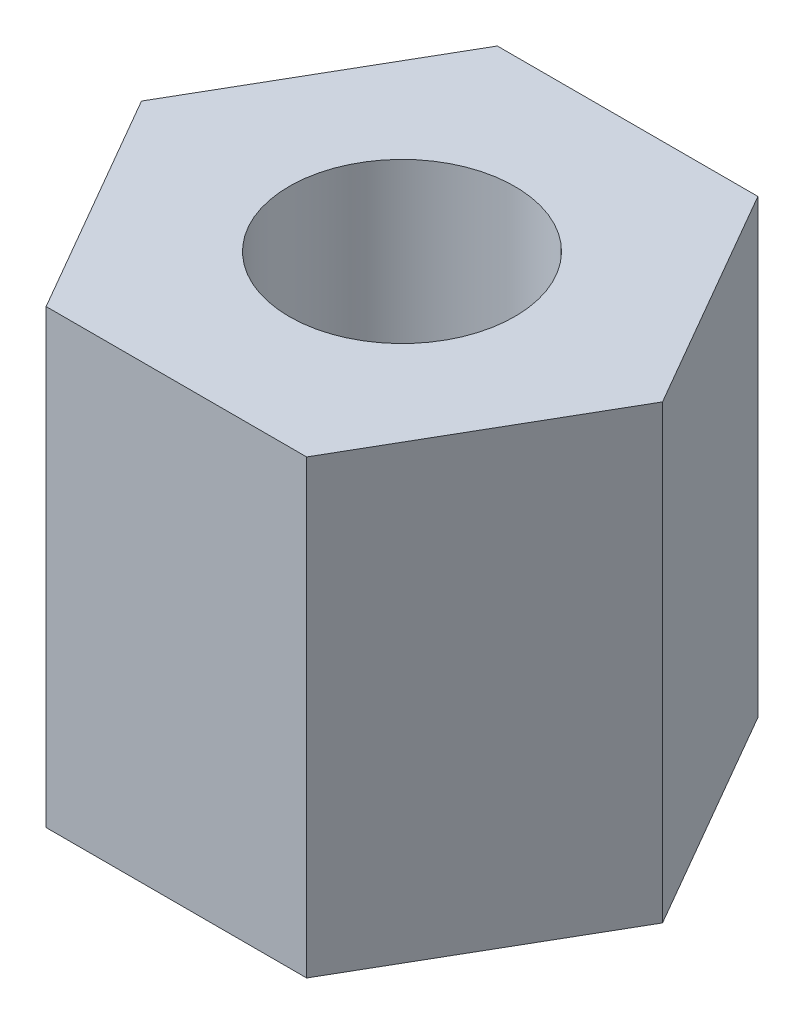
ISO-10303-21;
HEADER;
FILE_DESCRIPTION(('STEP AP214'),'2;1');
FILE_NAME('part.step','',(''),(''),'','','');
FILE_SCHEMA(('AUTOMOTIVE_DESIGN { 1 0 10303 214 1 1 1 1 }'));
ENDSEC;
DATA;
#1=APPLICATION_CONTEXT('core data for automotive mechanical design processes');
#2=APPLICATION_PROTOCOL_DEFINITION('international standard','automotive_design',2000,#1);
#3=PRODUCT_CONTEXT('',#1,'mechanical');
#4=PRODUCT('Part','Part','',(#3));
#5=PRODUCT_RELATED_PRODUCT_CATEGORY('part','',(#4));
#6=PRODUCT_DEFINITION_FORMATION('','',#4);
#7=PRODUCT_DEFINITION_CONTEXT('part definition',#1,'design');
#8=PRODUCT_DEFINITION('design','',#6,#7);
#9=PRODUCT_DEFINITION_SHAPE('','',#8);
#10=(LENGTH_UNIT() NAMED_UNIT(*) SI_UNIT(.MILLI.,.METRE.));
#11=(NAMED_UNIT(*) PLANE_ANGLE_UNIT() SI_UNIT($,.RADIAN.));
#12=(NAMED_UNIT(*) SI_UNIT($,.STERADIAN.) SOLID_ANGLE_UNIT());
#13=UNCERTAINTY_MEASURE_WITH_UNIT(LENGTH_MEASURE(1.E-05),#10,'distance_accuracy_value','');
#14=(GEOMETRIC_REPRESENTATION_CONTEXT(3) GLOBAL_UNCERTAINTY_ASSIGNED_CONTEXT((#13)) GLOBAL_UNIT_ASSIGNED_CONTEXT((#10,
#11,#12)) REPRESENTATION_CONTEXT('',''));
#15=CARTESIAN_POINT('',(0.,0.,0.));
#16=DIRECTION('',(0.,0.,1.));
#17=DIRECTION('',(1.,0.,0.));
#18=AXIS2_PLACEMENT_3D('',#15,#16,#17);
#19=CARTESIAN_POINT('',(0.,4.,0.));
#20=DIRECTION('',(0.,1.,0.));
#21=DIRECTION('',(0.,0.,1.));
#22=AXIS2_PLACEMENT_3D('',#19,#20,#21);
#23=PLANE('',#22);
#24=DIRECTION('',(0.499999999999995,0.,-0.866025403784442));
#25=VECTOR('',#24,1.);
#26=CARTESIAN_POINT('',(1.15470053837928,4.,1.99999999999999));
#27=LINE('',#26,#25);
#28=CARTESIAN_POINT('',(1.15470053837928,4.,1.99999999999999));
#29=VERTEX_POINT('',#28);
#30=CARTESIAN_POINT('',(2.3094010767585,4.,0.));
#31=VERTEX_POINT('',#30);
#32=EDGE_CURVE('E146',#29,#31,#27,.T.);
#33=ORIENTED_EDGE('',*,*,#32,.T.);
#34=DIRECTION('',(-0.500000000000001,0.,-0.866025403784438));
#35=VECTOR('',#34,1.);
#36=CARTESIAN_POINT('',(2.3094010767585,4.,0.));
#37=LINE('',#36,#35);
#38=CARTESIAN_POINT('',(1.15470053837925,4.,-2.));
#39=VERTEX_POINT('',#38);
#40=EDGE_CURVE('E94',#31,#39,#37,.T.);
#41=ORIENTED_EDGE('',*,*,#40,.T.);
#42=DIRECTION('',(-1.,0.,0.));
#43=VECTOR('',#42,1.);
#44=CARTESIAN_POINT('',(1.15470053837925,4.,-2.));
#45=LINE('',#44,#43);
#46=CARTESIAN_POINT('',(-1.15470053837926,4.,-2.));
#47=VERTEX_POINT('',#46);
#48=EDGE_CURVE('E107',#39,#47,#45,.T.);
#49=ORIENTED_EDGE('',*,*,#48,.T.);
#50=DIRECTION('',(-0.499999999999995,0.,0.866025403784442));
#51=VECTOR('',#50,1.);
#52=CARTESIAN_POINT('',(-1.15470053837926,4.,-2.));
#53=LINE('',#52,#51);
#54=CARTESIAN_POINT('',(-2.3094010767585,4.,0.));
#55=VERTEX_POINT('',#54);
#56=EDGE_CURVE('E101',#47,#55,#53,.T.);
#57=ORIENTED_EDGE('',*,*,#56,.T.);
#58=DIRECTION('',(0.500000000000007,0.,0.866025403784435));
#59=VECTOR('',#58,1.);
#60=CARTESIAN_POINT('',(-2.3094010767585,4.,0.));
#61=LINE('',#60,#59);
#62=CARTESIAN_POINT('',(-1.15470053837923,4.,2.00000000000001));
#63=VERTEX_POINT('',#62);
#64=EDGE_CURVE('E105',#55,#63,#61,.T.);
#65=ORIENTED_EDGE('',*,*,#64,.T.);
#66=DIRECTION('',(1.,0.,0.));
#67=VECTOR('',#66,1.);
#68=CARTESIAN_POINT('',(-1.15470053837923,4.,2.00000000000001));
#69=LINE('',#68,#67);
#70=EDGE_CURVE('E57',#63,#29,#69,.T.);
#71=ORIENTED_EDGE('',*,*,#70,.T.);
#72=EDGE_LOOP('',(#33,#41,#49,#57,#65,#71));
#73=FACE_BOUND('',#72,.T.);
#74=CARTESIAN_POINT('',(0.,4.,0.));
#75=DIRECTION('',(0.,1.,0.));
#76=DIRECTION('',(0.,0.,1.));
#77=AXIS2_PLACEMENT_3D('',#74,#75,#76);
#78=CIRCLE('',#77,1.);
#79=CARTESIAN_POINT('',(0.,4.,1.));
#80=VERTEX_POINT('',#79);
#81=EDGE_CURVE('E134',#80,#80,#78,.T.);
#82=ORIENTED_EDGE('',*,*,#81,.F.);
#83=EDGE_LOOP('',(#82));
#84=FACE_BOUND('',#83,.T.);
#85=ADVANCED_FACE('F39',(#73,#84),#23,.T.);
#86=CARTESIAN_POINT('',(0.,0.,0.));
#87=DIRECTION('',(0.,1.,0.));
#88=DIRECTION('',(0.,0.,1.));
#89=AXIS2_PLACEMENT_3D('',#86,#87,#88);
#90=PLANE('',#89);
#91=DIRECTION('',(0.499999999999995,0.,-0.866025403784442));
#92=VECTOR('',#91,1.);
#93=CARTESIAN_POINT('',(1.15470053837928,0.,1.99999999999999));
#94=LINE('',#93,#92);
#95=CARTESIAN_POINT('',(1.15470053837928,0.,1.99999999999999));
#96=VERTEX_POINT('',#95);
#97=CARTESIAN_POINT('',(2.3094010767585,0.,0.));
#98=VERTEX_POINT('',#97);
#99=EDGE_CURVE('E129',#96,#98,#94,.T.);
#100=ORIENTED_EDGE('',*,*,#99,.F.);
#101=DIRECTION('',(1.,0.,0.));
#102=VECTOR('',#101,1.);
#103=CARTESIAN_POINT('',(-1.15470053837923,0.,2.00000000000001));
#104=LINE('',#103,#102);
#105=CARTESIAN_POINT('',(-1.15470053837923,0.,2.00000000000001));
#106=VERTEX_POINT('',#105);
#107=EDGE_CURVE('E86',#106,#96,#104,.T.);
#108=ORIENTED_EDGE('',*,*,#107,.F.);
#109=DIRECTION('',(0.500000000000007,0.,0.866025403784435));
#110=VECTOR('',#109,1.);
#111=CARTESIAN_POINT('',(-2.3094010767585,0.,0.));
#112=LINE('',#111,#110);
#113=CARTESIAN_POINT('',(-2.3094010767585,0.,0.));
#114=VERTEX_POINT('',#113);
#115=EDGE_CURVE('E80',#114,#106,#112,.T.);
#116=ORIENTED_EDGE('',*,*,#115,.F.);
#117=DIRECTION('',(-0.499999999999995,0.,0.866025403784442));
#118=VECTOR('',#117,1.);
#119=CARTESIAN_POINT('',(-1.15470053837926,0.,-2.));
#120=LINE('',#119,#118);
#121=CARTESIAN_POINT('',(-1.15470053837926,0.,-2.));
#122=VERTEX_POINT('',#121);
#123=EDGE_CURVE('E116',#122,#114,#120,.T.);
#124=ORIENTED_EDGE('',*,*,#123,.F.);
#125=DIRECTION('',(-1.,0.,0.));
#126=VECTOR('',#125,1.);
#127=CARTESIAN_POINT('',(1.15470053837925,0.,-2.));
#128=LINE('',#127,#126);
#129=CARTESIAN_POINT('',(1.15470053837925,0.,-2.));
#130=VERTEX_POINT('',#129);
#131=EDGE_CURVE('E137',#130,#122,#128,.T.);
#132=ORIENTED_EDGE('',*,*,#131,.F.);
#133=DIRECTION('',(-0.500000000000001,0.,-0.866025403784438));
#134=VECTOR('',#133,1.);
#135=CARTESIAN_POINT('',(2.3094010767585,0.,0.));
#136=LINE('',#135,#134);
#137=EDGE_CURVE('E133',#98,#130,#136,.T.);
#138=ORIENTED_EDGE('',*,*,#137,.F.);
#139=EDGE_LOOP('',(#100,#108,#116,#124,#132,#138));
#140=FACE_BOUND('',#139,.T.);
#141=CARTESIAN_POINT('',(0.,0.,0.));
#142=DIRECTION('',(0.,1.,0.));
#143=DIRECTION('',(0.,0.,1.));
#144=AXIS2_PLACEMENT_3D('',#141,#142,#143);
#145=CIRCLE('',#144,1.);
#146=CARTESIAN_POINT('',(0.,0.,1.));
#147=VERTEX_POINT('',#146);
#148=EDGE_CURVE('E243',#147,#147,#145,.T.);
#149=ORIENTED_EDGE('',*,*,#148,.T.);
#150=EDGE_LOOP('',(#149));
#151=FACE_BOUND('',#150,.T.);
#152=ADVANCED_FACE('F159',(#140,#151),#90,.F.);
#153=CARTESIAN_POINT('',(1.15470053837928,4.,1.99999999999999));
#154=DIRECTION('',(-0.866025403784442,0.,-0.499999999999995));
#155=DIRECTION('',(-0.499999999999995,0.,0.866025403784442));
#156=AXIS2_PLACEMENT_3D('',#153,#154,#155);
#157=PLANE('',#156);
#158=ORIENTED_EDGE('',*,*,#99,.T.);
#159=DIRECTION('',(0.,-1.,0.));
#160=VECTOR('',#159,1.);
#161=CARTESIAN_POINT('',(2.3094010767585,4.,0.));
#162=LINE('',#161,#160);
#163=EDGE_CURVE('E11',#31,#98,#162,.T.);
#164=ORIENTED_EDGE('',*,*,#163,.F.);
#165=ORIENTED_EDGE('',*,*,#32,.F.);
#166=DIRECTION('',(0.,-1.,0.));
#167=VECTOR('',#166,1.);
#168=CARTESIAN_POINT('',(1.15470053837928,4.,1.99999999999999));
#169=LINE('',#168,#167);
#170=EDGE_CURVE('E125',#29,#96,#169,.T.);
#171=ORIENTED_EDGE('',*,*,#170,.T.);
#172=EDGE_LOOP('',(#158,#164,#165,#171));
#173=FACE_BOUND('',#172,.T.);
#174=ADVANCED_FACE('F41',(#173),#157,.F.);
#175=CARTESIAN_POINT('',(2.3094010767585,4.,0.));
#176=DIRECTION('',(-0.866025403784438,0.,0.500000000000001));
#177=DIRECTION('',(0.500000000000001,0.,0.866025403784438));
#178=AXIS2_PLACEMENT_3D('',#175,#176,#177);
#179=PLANE('',#178);
#180=ORIENTED_EDGE('',*,*,#137,.T.);
#181=DIRECTION('',(0.,-1.,0.));
#182=VECTOR('',#181,1.);
#183=CARTESIAN_POINT('',(1.15470053837925,4.,-2.));
#184=LINE('',#183,#182);
#185=EDGE_CURVE('E49',#39,#130,#184,.T.);
#186=ORIENTED_EDGE('',*,*,#185,.F.);
#187=ORIENTED_EDGE('',*,*,#40,.F.);
#188=ORIENTED_EDGE('',*,*,#163,.T.);
#189=EDGE_LOOP('',(#180,#186,#187,#188));
#190=FACE_BOUND('',#189,.T.);
#191=ADVANCED_FACE('F184',(#190),#179,.F.);
#192=CARTESIAN_POINT('',(1.15470053837925,4.,-2.));
#193=DIRECTION('',(0.,0.,1.));
#194=DIRECTION('',(1.,0.,0.));
#195=AXIS2_PLACEMENT_3D('',#192,#193,#194);
#196=PLANE('',#195);
#197=ORIENTED_EDGE('',*,*,#131,.T.);
#198=DIRECTION('',(0.,-1.,0.));
#199=VECTOR('',#198,1.);
#200=CARTESIAN_POINT('',(-1.15470053837926,4.,-2.));
#201=LINE('',#200,#199);
#202=EDGE_CURVE('E118',#47,#122,#201,.T.);
#203=ORIENTED_EDGE('',*,*,#202,.F.);
#204=ORIENTED_EDGE('',*,*,#48,.F.);
#205=ORIENTED_EDGE('',*,*,#185,.T.);
#206=EDGE_LOOP('',(#197,#203,#204,#205));
#207=FACE_BOUND('',#206,.T.);
#208=ADVANCED_FACE('F156',(#207),#196,.F.);
#209=CARTESIAN_POINT('',(-1.15470053837926,4.,-2.));
#210=DIRECTION('',(0.866025403784442,0.,0.499999999999995));
#211=DIRECTION('',(0.499999999999995,0.,-0.866025403784442));
#212=AXIS2_PLACEMENT_3D('',#209,#210,#211);
#213=PLANE('',#212);
#214=ORIENTED_EDGE('',*,*,#123,.T.);
#215=DIRECTION('',(0.,-1.,0.));
#216=VECTOR('',#215,1.);
#217=CARTESIAN_POINT('',(-2.3094010767585,4.,0.));
#218=LINE('',#217,#216);
#219=EDGE_CURVE('E113',#55,#114,#218,.T.);
#220=ORIENTED_EDGE('',*,*,#219,.F.);
#221=ORIENTED_EDGE('',*,*,#56,.F.);
#222=ORIENTED_EDGE('',*,*,#202,.T.);
#223=EDGE_LOOP('',(#214,#220,#221,#222));
#224=FACE_BOUND('',#223,.T.);
#225=ADVANCED_FACE('F114',(#224),#213,.F.);
#226=CARTESIAN_POINT('',(-2.3094010767585,4.,0.));
#227=DIRECTION('',(0.866025403784435,0.,-0.500000000000007));
#228=DIRECTION('',(-0.500000000000007,0.,-0.866025403784435));
#229=AXIS2_PLACEMENT_3D('',#226,#227,#228);
#230=PLANE('',#229);
#231=ORIENTED_EDGE('',*,*,#115,.T.);
#232=DIRECTION('',(0.,-1.,0.));
#233=VECTOR('',#232,1.);
#234=CARTESIAN_POINT('',(-1.15470053837923,4.,2.00000000000001));
#235=LINE('',#234,#233);
#236=EDGE_CURVE('E119',#63,#106,#235,.T.);
#237=ORIENTED_EDGE('',*,*,#236,.F.);
#238=ORIENTED_EDGE('',*,*,#64,.F.);
#239=ORIENTED_EDGE('',*,*,#219,.T.);
#240=EDGE_LOOP('',(#231,#237,#238,#239));
#241=FACE_BOUND('',#240,.T.);
#242=ADVANCED_FACE('F121',(#241),#230,.F.);
#243=CARTESIAN_POINT('',(-1.15470053837923,4.,2.00000000000001));
#244=DIRECTION('',(0.,0.,-1.));
#245=DIRECTION('',(-1.,0.,0.));
#246=AXIS2_PLACEMENT_3D('',#243,#244,#245);
#247=PLANE('',#246);
#248=ORIENTED_EDGE('',*,*,#107,.T.);
#249=ORIENTED_EDGE('',*,*,#170,.F.);
#250=ORIENTED_EDGE('',*,*,#70,.F.);
#251=ORIENTED_EDGE('',*,*,#236,.T.);
#252=EDGE_LOOP('',(#248,#249,#250,#251));
#253=FACE_BOUND('',#252,.T.);
#254=ADVANCED_FACE('F164',(#253),#247,.F.);
#255=CARTESIAN_POINT('',(0.,4.,0.));
#256=DIRECTION('',(0.,-1.,0.));
#257=DIRECTION('',(0.,0.,-1.));
#258=AXIS2_PLACEMENT_3D('',#255,#256,#257);
#259=CYLINDRICAL_SURFACE('',#258,1.);
#260=ORIENTED_EDGE('',*,*,#81,.T.);
#261=EDGE_LOOP('',(#260));
#262=FACE_BOUND('',#261,.T.);
#263=ORIENTED_EDGE('',*,*,#148,.F.);
#264=EDGE_LOOP('',(#263));
#265=FACE_BOUND('',#264,.T.);
#266=ADVANCED_FACE('F166',(#262,#265),#259,.F.);
#267=CLOSED_SHELL('',(#85,#152,#174,#191,#208,#225,#242,#254,#266));
#268=MANIFOLD_SOLID_BREP('B2',#267);
#269=ADVANCED_BREP_SHAPE_REPRESENTATION('',(#18,#268),#14);
#270=SHAPE_DEFINITION_REPRESENTATION(#9,#269);
ENDSEC;
END-ISO-10303-21;
